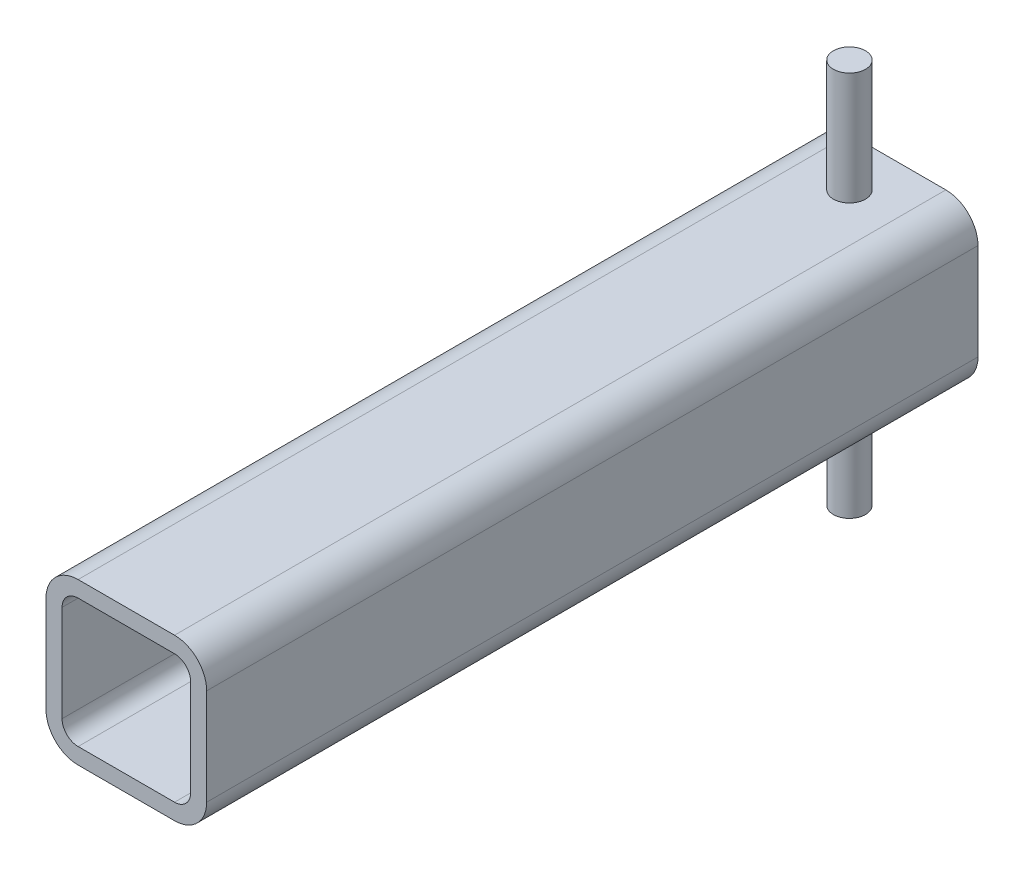
ISO-10303-21;
HEADER;
FILE_DESCRIPTION(('STEP AP214'),'2;1');
FILE_NAME('part.step','',(''),(''),'','','');
FILE_SCHEMA(('AUTOMOTIVE_DESIGN { 1 0 10303 214 1 1 1 1 }'));
ENDSEC;
DATA;
#1=APPLICATION_CONTEXT('core data for automotive mechanical design processes');
#2=APPLICATION_PROTOCOL_DEFINITION('international standard','automotive_design',2000,#1);
#3=PRODUCT_CONTEXT('',#1,'mechanical');
#4=PRODUCT('Part','Part','',(#3));
#5=PRODUCT_RELATED_PRODUCT_CATEGORY('part','',(#4));
#6=PRODUCT_DEFINITION_FORMATION('','',#4);
#7=PRODUCT_DEFINITION_CONTEXT('part definition',#1,'design');
#8=PRODUCT_DEFINITION('design','',#6,#7);
#9=PRODUCT_DEFINITION_SHAPE('','',#8);
#10=(LENGTH_UNIT() NAMED_UNIT(*) SI_UNIT(.MILLI.,.METRE.));
#11=(NAMED_UNIT(*) PLANE_ANGLE_UNIT() SI_UNIT($,.RADIAN.));
#12=(NAMED_UNIT(*) SI_UNIT($,.STERADIAN.) SOLID_ANGLE_UNIT());
#13=UNCERTAINTY_MEASURE_WITH_UNIT(LENGTH_MEASURE(1.E-05),#10,'distance_accuracy_value','');
#14=(GEOMETRIC_REPRESENTATION_CONTEXT(3) GLOBAL_UNCERTAINTY_ASSIGNED_CONTEXT((#13)) GLOBAL_UNIT_ASSIGNED_CONTEXT((#10,
#11,#12)) REPRESENTATION_CONTEXT('',''));
#15=CARTESIAN_POINT('',(0.,0.,0.));
#16=DIRECTION('',(0.,0.,1.));
#17=DIRECTION('',(1.,0.,0.));
#18=AXIS2_PLACEMENT_3D('',#15,#16,#17);
#19=CARTESIAN_POINT('',(0.,31.75,304.8));
#20=DIRECTION('',(0.,-1.,0.));
#21=DIRECTION('',(1.,0.,0.));
#22=AXIS2_PLACEMENT_3D('',#19,#20,#21);
#23=PLANE('',#22);
#24=DIRECTION('',(-1.,0.,0.));
#25=VECTOR('',#24,1.);
#26=CARTESIAN_POINT('',(0.,31.75,0.));
#27=LINE('',#26,#25);
#28=CARTESIAN_POINT('',(19.05,31.75,0.));
#29=VERTEX_POINT('',#28);
#30=CARTESIAN_POINT('',(-19.05,31.75,0.));
#31=VERTEX_POINT('',#30);
#32=EDGE_CURVE('E254',#29,#31,#27,.T.);
#33=ORIENTED_EDGE('',*,*,#32,.T.);
#34=DIRECTION('',(0.,0.,-1.));
#35=VECTOR('',#34,1.);
#36=CARTESIAN_POINT('',(-19.05,31.75,304.8));
#37=LINE('',#36,#35);
#38=CARTESIAN_POINT('',(-19.05,31.75,304.8));
#39=VERTEX_POINT('',#38);
#40=EDGE_CURVE('E297',#39,#31,#37,.T.);
#41=ORIENTED_EDGE('',*,*,#40,.F.);
#42=DIRECTION('',(-1.,0.,0.));
#43=VECTOR('',#42,1.);
#44=CARTESIAN_POINT('',(0.,31.75,304.8));
#45=LINE('',#44,#43);
#46=CARTESIAN_POINT('',(19.05,31.75,304.8));
#47=VERTEX_POINT('',#46);
#48=EDGE_CURVE('E382',#47,#39,#45,.T.);
#49=ORIENTED_EDGE('',*,*,#48,.F.);
#50=DIRECTION('',(0.,0.,-1.));
#51=VECTOR('',#50,1.);
#52=CARTESIAN_POINT('',(19.05,31.75,304.8));
#53=LINE('',#52,#51);
#54=EDGE_CURVE('E280',#47,#29,#53,.T.);
#55=ORIENTED_EDGE('',*,*,#54,.T.);
#56=EDGE_LOOP('',(#33,#41,#49,#55));
#57=FACE_BOUND('',#56,.T.);
#58=CARTESIAN_POINT('',(0.,31.75,19.05));
#59=DIRECTION('',(0.,-1.,0.));
#60=DIRECTION('',(1.,0.,0.));
#61=AXIS2_PLACEMENT_3D('',#58,#59,#60);
#62=CIRCLE('',#61,6.35);
#63=CARTESIAN_POINT('',(6.35,31.75,19.05));
#64=VERTEX_POINT('',#63);
#65=EDGE_CURVE('E11',#64,#64,#62,.F.);
#66=ORIENTED_EDGE('',*,*,#65,.F.);
#67=EDGE_LOOP('',(#66));
#68=FACE_BOUND('',#67,.T.);
#69=ADVANCED_FACE('F39',(#57,#68),#23,.F.);
#70=CARTESIAN_POINT('',(0.,-31.75,304.8));
#71=DIRECTION('',(0.,1.,0.));
#72=DIRECTION('',(-1.,0.,0.));
#73=AXIS2_PLACEMENT_3D('',#70,#71,#72);
#74=PLANE('',#73);
#75=DIRECTION('',(1.,0.,0.));
#76=VECTOR('',#75,1.);
#77=CARTESIAN_POINT('',(0.,-31.75,0.));
#78=LINE('',#77,#76);
#79=CARTESIAN_POINT('',(-19.05,-31.75,0.));
#80=VERTEX_POINT('',#79);
#81=CARTESIAN_POINT('',(19.05,-31.75,0.));
#82=VERTEX_POINT('',#81);
#83=EDGE_CURVE('E269',#80,#82,#78,.T.);
#84=ORIENTED_EDGE('',*,*,#83,.T.);
#85=DIRECTION('',(0.,0.,-1.));
#86=VECTOR('',#85,1.);
#87=CARTESIAN_POINT('',(19.05,-31.75,304.8));
#88=LINE('',#87,#86);
#89=CARTESIAN_POINT('',(19.05,-31.75,304.8));
#90=VERTEX_POINT('',#89);
#91=EDGE_CURVE('E209',#90,#82,#88,.T.);
#92=ORIENTED_EDGE('',*,*,#91,.F.);
#93=DIRECTION('',(1.,0.,0.));
#94=VECTOR('',#93,1.);
#95=CARTESIAN_POINT('',(0.,-31.75,304.8));
#96=LINE('',#95,#94);
#97=CARTESIAN_POINT('',(-19.05,-31.75,304.8));
#98=VERTEX_POINT('',#97);
#99=EDGE_CURVE('E194',#98,#90,#96,.T.);
#100=ORIENTED_EDGE('',*,*,#99,.F.);
#101=DIRECTION('',(0.,0.,-1.));
#102=VECTOR('',#101,1.);
#103=CARTESIAN_POINT('',(-19.05,-31.75,304.8));
#104=LINE('',#103,#102);
#105=EDGE_CURVE('E287',#98,#80,#104,.T.);
#106=ORIENTED_EDGE('',*,*,#105,.T.);
#107=EDGE_LOOP('',(#84,#92,#100,#106));
#108=FACE_BOUND('',#107,.T.);
#109=CARTESIAN_POINT('',(0.,-31.75,19.05));
#110=DIRECTION('',(0.,1.,0.));
#111=DIRECTION('',(-1.,0.,0.));
#112=AXIS2_PLACEMENT_3D('',#109,#110,#111);
#113=CIRCLE('',#112,6.35);
#114=CARTESIAN_POINT('',(-6.35,-31.75,19.05));
#115=VERTEX_POINT('',#114);
#116=EDGE_CURVE('E50',#115,#115,#113,.F.);
#117=ORIENTED_EDGE('',*,*,#116,.F.);
#118=EDGE_LOOP('',(#117));
#119=FACE_BOUND('',#118,.T.);
#120=ADVANCED_FACE('F435',(#108,#119),#74,.F.);
#121=CARTESIAN_POINT('',(0.,25.4,304.8));
#122=DIRECTION('',(0.,-1.,0.));
#123=DIRECTION('',(1.,0.,0.));
#124=AXIS2_PLACEMENT_3D('',#121,#122,#123);
#125=PLANE('',#124);
#126=DIRECTION('',(-1.,0.,0.));
#127=VECTOR('',#126,1.);
#128=CARTESIAN_POINT('',(0.,25.4,0.));
#129=LINE('',#128,#127);
#130=CARTESIAN_POINT('',(19.05,25.4,0.));
#131=VERTEX_POINT('',#130);
#132=CARTESIAN_POINT('',(-19.05,25.4,0.));
#133=VERTEX_POINT('',#132);
#134=EDGE_CURVE('E234',#131,#133,#129,.T.);
#135=ORIENTED_EDGE('',*,*,#134,.F.);
#136=DIRECTION('',(0.,0.,-1.));
#137=VECTOR('',#136,1.);
#138=CARTESIAN_POINT('',(19.05,25.4,304.8));
#139=LINE('',#138,#137);
#140=CARTESIAN_POINT('',(19.05,25.4,304.8));
#141=VERTEX_POINT('',#140);
#142=EDGE_CURVE('E312',#141,#131,#139,.T.);
#143=ORIENTED_EDGE('',*,*,#142,.F.);
#144=DIRECTION('',(-1.,0.,0.));
#145=VECTOR('',#144,1.);
#146=CARTESIAN_POINT('',(0.,25.4,304.8));
#147=LINE('',#146,#145);
#148=CARTESIAN_POINT('',(-19.05,25.4,304.8));
#149=VERTEX_POINT('',#148);
#150=EDGE_CURVE('E362',#141,#149,#147,.T.);
#151=ORIENTED_EDGE('',*,*,#150,.T.);
#152=DIRECTION('',(0.,0.,-1.));
#153=VECTOR('',#152,1.);
#154=CARTESIAN_POINT('',(-19.05,25.4,304.8));
#155=LINE('',#154,#153);
#156=EDGE_CURVE('E315',#149,#133,#155,.T.);
#157=ORIENTED_EDGE('',*,*,#156,.T.);
#158=EDGE_LOOP('',(#135,#143,#151,#157));
#159=FACE_BOUND('',#158,.T.);
#160=CARTESIAN_POINT('',(0.,25.4,19.05));
#161=DIRECTION('',(0.,-1.,0.));
#162=DIRECTION('',(1.,0.,0.));
#163=AXIS2_PLACEMENT_3D('',#160,#161,#162);
#164=CIRCLE('',#163,6.35);
#165=CARTESIAN_POINT('',(6.35,25.4,19.05));
#166=VERTEX_POINT('',#165);
#167=EDGE_CURVE('E226',#166,#166,#164,.F.);
#168=ORIENTED_EDGE('',*,*,#167,.T.);
#169=EDGE_LOOP('',(#168));
#170=FACE_BOUND('',#169,.T.);
#171=ADVANCED_FACE('F358',(#159,#170),#125,.T.);
#172=CARTESIAN_POINT('',(0.,-25.4,304.8));
#173=DIRECTION('',(0.,1.,0.));
#174=DIRECTION('',(-1.,0.,0.));
#175=AXIS2_PLACEMENT_3D('',#172,#173,#174);
#176=PLANE('',#175);
#177=DIRECTION('',(1.,0.,0.));
#178=VECTOR('',#177,1.);
#179=CARTESIAN_POINT('',(0.,-25.4,0.));
#180=LINE('',#179,#178);
#181=CARTESIAN_POINT('',(-19.05,-25.4,0.));
#182=VERTEX_POINT('',#181);
#183=CARTESIAN_POINT('',(19.05,-25.4,0.));
#184=VERTEX_POINT('',#183);
#185=EDGE_CURVE('E250',#182,#184,#180,.T.);
#186=ORIENTED_EDGE('',*,*,#185,.F.);
#187=DIRECTION('',(0.,0.,-1.));
#188=VECTOR('',#187,1.);
#189=CARTESIAN_POINT('',(-19.05,-25.4,304.8));
#190=LINE('',#189,#188);
#191=CARTESIAN_POINT('',(-19.05,-25.4,304.8));
#192=VERTEX_POINT('',#191);
#193=EDGE_CURVE('E217',#192,#182,#190,.T.);
#194=ORIENTED_EDGE('',*,*,#193,.F.);
#195=DIRECTION('',(1.,0.,0.));
#196=VECTOR('',#195,1.);
#197=CARTESIAN_POINT('',(0.,-25.4,304.8));
#198=LINE('',#197,#196);
#199=CARTESIAN_POINT('',(19.05,-25.4,304.8));
#200=VERTEX_POINT('',#199);
#201=EDGE_CURVE('E337',#192,#200,#198,.T.);
#202=ORIENTED_EDGE('',*,*,#201,.T.);
#203=DIRECTION('',(0.,0.,-1.));
#204=VECTOR('',#203,1.);
#205=CARTESIAN_POINT('',(19.05,-25.4,304.8));
#206=LINE('',#205,#204);
#207=EDGE_CURVE('E303',#200,#184,#206,.T.);
#208=ORIENTED_EDGE('',*,*,#207,.T.);
#209=EDGE_LOOP('',(#186,#194,#202,#208));
#210=FACE_BOUND('',#209,.T.);
#211=CARTESIAN_POINT('',(0.,-25.4,19.05));
#212=DIRECTION('',(0.,1.,0.));
#213=DIRECTION('',(-1.,0.,0.));
#214=AXIS2_PLACEMENT_3D('',#211,#212,#213);
#215=CIRCLE('',#214,6.35);
#216=CARTESIAN_POINT('',(-6.35,-25.4,19.05));
#217=VERTEX_POINT('',#216);
#218=EDGE_CURVE('E43',#217,#217,#215,.F.);
#219=ORIENTED_EDGE('',*,*,#218,.T.);
#220=EDGE_LOOP('',(#219));
#221=FACE_BOUND('',#220,.T.);
#222=ADVANCED_FACE('F335',(#210,#221),#176,.T.);
#223=CARTESIAN_POINT('',(-19.05,19.05,304.8));
#224=DIRECTION('',(0.,0.,-1.));
#225=DIRECTION('',(-1.,0.,0.));
#226=AXIS2_PLACEMENT_3D('',#223,#224,#225);
#227=CYLINDRICAL_SURFACE('',#226,12.7);
#228=CARTESIAN_POINT('',(-19.05,19.05,0.));
#229=DIRECTION('',(0.,0.,1.));
#230=DIRECTION('',(1.,0.,0.));
#231=AXIS2_PLACEMENT_3D('',#228,#229,#230);
#232=CIRCLE('',#231,12.7);
#233=CARTESIAN_POINT('',(-31.75,19.05,0.));
#234=VERTEX_POINT('',#233);
#235=EDGE_CURVE('E258',#31,#234,#232,.T.);
#236=ORIENTED_EDGE('',*,*,#235,.T.);
#237=DIRECTION('',(0.,0.,-1.));
#238=VECTOR('',#237,1.);
#239=CARTESIAN_POINT('',(-31.75,19.05,304.8));
#240=LINE('',#239,#238);
#241=CARTESIAN_POINT('',(-31.75,19.05,304.8));
#242=VERTEX_POINT('',#241);
#243=EDGE_CURVE('E294',#242,#234,#240,.T.);
#244=ORIENTED_EDGE('',*,*,#243,.F.);
#245=CARTESIAN_POINT('',(-19.05,19.05,304.8));
#246=DIRECTION('',(0.,0.,1.));
#247=DIRECTION('',(1.,0.,0.));
#248=AXIS2_PLACEMENT_3D('',#245,#246,#247);
#249=CIRCLE('',#248,12.7);
#250=EDGE_CURVE('E384',#39,#242,#249,.T.);
#251=ORIENTED_EDGE('',*,*,#250,.F.);
#252=ORIENTED_EDGE('',*,*,#40,.T.);
#253=EDGE_LOOP('',(#236,#244,#251,#252));
#254=FACE_BOUND('',#253,.T.);
#255=ADVANCED_FACE('F446',(#254),#227,.T.);
#256=CARTESIAN_POINT('',(-31.7499999999999,-69.9914213562374,304.8));
#257=DIRECTION('',(-1.,0.,0.));
#258=DIRECTION('',(0.,-1.,0.));
#259=AXIS2_PLACEMENT_3D('',#256,#257,#258);
#260=PLANE('',#259);
#261=DIRECTION('',(0.,1.,0.));
#262=VECTOR('',#261,1.);
#263=CARTESIAN_POINT('',(-31.7499999999999,-69.9914213562374,0.));
#264=LINE('',#263,#262);
#265=CARTESIAN_POINT('',(-31.75,-19.05,0.));
#266=VERTEX_POINT('',#265);
#267=EDGE_CURVE('E262',#266,#234,#264,.T.);
#268=ORIENTED_EDGE('',*,*,#267,.F.);
#269=DIRECTION('',(0.,0.,-1.));
#270=VECTOR('',#269,1.);
#271=CARTESIAN_POINT('',(-31.75,-19.05,304.8));
#272=LINE('',#271,#270);
#273=CARTESIAN_POINT('',(-31.75,-19.05,304.8));
#274=VERTEX_POINT('',#273);
#275=EDGE_CURVE('E291',#274,#266,#272,.T.);
#276=ORIENTED_EDGE('',*,*,#275,.F.);
#277=DIRECTION('',(0.,1.,0.));
#278=VECTOR('',#277,1.);
#279=CARTESIAN_POINT('',(-31.7499999999999,-69.9914213562374,304.8));
#280=LINE('',#279,#278);
#281=EDGE_CURVE('E386',#274,#242,#280,.T.);
#282=ORIENTED_EDGE('',*,*,#281,.T.);
#283=ORIENTED_EDGE('',*,*,#243,.T.);
#284=EDGE_LOOP('',(#268,#276,#282,#283));
#285=FACE_BOUND('',#284,.T.);
#286=ADVANCED_FACE('F476',(#285),#260,.T.);
#287=CARTESIAN_POINT('',(-19.05,-19.05,304.8));
#288=DIRECTION('',(0.,0.,-1.));
#289=DIRECTION('',(-1.,0.,0.));
#290=AXIS2_PLACEMENT_3D('',#287,#288,#289);
#291=CYLINDRICAL_SURFACE('',#290,12.7);
#292=CARTESIAN_POINT('',(-19.05,-19.05,0.));
#293=DIRECTION('',(0.,0.,1.));
#294=DIRECTION('',(1.,0.,0.));
#295=AXIS2_PLACEMENT_3D('',#292,#293,#294);
#296=CIRCLE('',#295,12.7);
#297=EDGE_CURVE('E266',#266,#80,#296,.T.);
#298=ORIENTED_EDGE('',*,*,#297,.T.);
#299=ORIENTED_EDGE('',*,*,#105,.F.);
#300=CARTESIAN_POINT('',(-19.05,-19.05,304.8));
#301=DIRECTION('',(0.,0.,1.));
#302=DIRECTION('',(1.,0.,0.));
#303=AXIS2_PLACEMENT_3D('',#300,#301,#302);
#304=CIRCLE('',#303,12.7);
#305=EDGE_CURVE('E390',#274,#98,#304,.T.);
#306=ORIENTED_EDGE('',*,*,#305,.F.);
#307=ORIENTED_EDGE('',*,*,#275,.T.);
#308=EDGE_LOOP('',(#298,#299,#306,#307));
#309=FACE_BOUND('',#308,.T.);
#310=ADVANCED_FACE('F471',(#309),#291,.T.);
#311=CARTESIAN_POINT('',(19.05,-19.05,304.8));
#312=DIRECTION('',(0.,0.,-1.));
#313=DIRECTION('',(-1.,0.,0.));
#314=AXIS2_PLACEMENT_3D('',#311,#312,#313);
#315=CYLINDRICAL_SURFACE('',#314,12.7);
#316=CARTESIAN_POINT('',(19.05,-19.05,0.));
#317=DIRECTION('',(0.,0.,1.));
#318=DIRECTION('',(1.,0.,0.));
#319=AXIS2_PLACEMENT_3D('',#316,#317,#318);
#320=CIRCLE('',#319,12.7);
#321=CARTESIAN_POINT('',(31.75,-19.05,0.));
#322=VERTEX_POINT('',#321);
#323=EDGE_CURVE('E204',#82,#322,#320,.T.);
#324=ORIENTED_EDGE('',*,*,#323,.T.);
#325=DIRECTION('',(0.,0.,-1.));
#326=VECTOR('',#325,1.);
#327=CARTESIAN_POINT('',(31.75,-19.05,304.8));
#328=LINE('',#327,#326);
#329=CARTESIAN_POINT('',(31.75,-19.05,304.8));
#330=VERTEX_POINT('',#329);
#331=EDGE_CURVE('E201',#330,#322,#328,.T.);
#332=ORIENTED_EDGE('',*,*,#331,.F.);
#333=CARTESIAN_POINT('',(19.05,-19.05,304.8));
#334=DIRECTION('',(0.,0.,1.));
#335=DIRECTION('',(1.,0.,0.));
#336=AXIS2_PLACEMENT_3D('',#333,#334,#335);
#337=CIRCLE('',#336,12.7);
#338=EDGE_CURVE('E188',#90,#330,#337,.T.);
#339=ORIENTED_EDGE('',*,*,#338,.F.);
#340=ORIENTED_EDGE('',*,*,#91,.T.);
#341=EDGE_LOOP('',(#324,#332,#339,#340));
#342=FACE_BOUND('',#341,.T.);
#343=ADVANCED_FACE('F202',(#342),#315,.T.);
#344=CARTESIAN_POINT('',(31.7500000000001,-69.9914213562373,304.8));
#345=DIRECTION('',(1.,0.,0.));
#346=DIRECTION('',(0.,1.,0.));
#347=AXIS2_PLACEMENT_3D('',#344,#345,#346);
#348=PLANE('',#347);
#349=DIRECTION('',(0.,-1.,0.));
#350=VECTOR('',#349,1.);
#351=CARTESIAN_POINT('',(31.7500000000001,-69.9914213562373,0.));
#352=LINE('',#351,#350);
#353=CARTESIAN_POINT('',(31.75,19.05,0.));
#354=VERTEX_POINT('',#353);
#355=EDGE_CURVE('E274',#354,#322,#352,.T.);
#356=ORIENTED_EDGE('',*,*,#355,.F.);
#357=DIRECTION('',(0.,0.,-1.));
#358=VECTOR('',#357,1.);
#359=CARTESIAN_POINT('',(31.75,19.05,304.8));
#360=LINE('',#359,#358);
#361=CARTESIAN_POINT('',(31.75,19.05,304.8));
#362=VERTEX_POINT('',#361);
#363=EDGE_CURVE('E128',#362,#354,#360,.T.);
#364=ORIENTED_EDGE('',*,*,#363,.F.);
#365=DIRECTION('',(0.,-1.,0.));
#366=VECTOR('',#365,1.);
#367=CARTESIAN_POINT('',(31.7500000000001,-69.9914213562373,304.8));
#368=LINE('',#367,#366);
#369=EDGE_CURVE('E192',#362,#330,#368,.T.);
#370=ORIENTED_EDGE('',*,*,#369,.T.);
#371=ORIENTED_EDGE('',*,*,#331,.T.);
#372=EDGE_LOOP('',(#356,#364,#370,#371));
#373=FACE_BOUND('',#372,.T.);
#374=ADVANCED_FACE('F211',(#373),#348,.T.);
#375=CARTESIAN_POINT('',(-19.05,-19.05,304.8));
#376=DIRECTION('',(0.,0.,-1.));
#377=DIRECTION('',(-1.,0.,0.));
#378=AXIS2_PLACEMENT_3D('',#375,#376,#377);
#379=CYLINDRICAL_SURFACE('',#378,6.34999999999999);
#380=CARTESIAN_POINT('',(-19.05,-19.05,0.));
#381=DIRECTION('',(0.,0.,1.));
#382=DIRECTION('',(1.,0.,0.));
#383=AXIS2_PLACEMENT_3D('',#380,#381,#382);
#384=CIRCLE('',#383,6.34999999999999);
#385=CARTESIAN_POINT('',(-25.4,-19.05,0.));
#386=VERTEX_POINT('',#385);
#387=EDGE_CURVE('E221',#386,#182,#384,.T.);
#388=ORIENTED_EDGE('',*,*,#387,.F.);
#389=DIRECTION('',(0.,0.,-1.));
#390=VECTOR('',#389,1.);
#391=CARTESIAN_POINT('',(-25.4,-19.05,304.8));
#392=LINE('',#391,#390);
#393=CARTESIAN_POINT('',(-25.4,-19.05,304.8));
#394=VERTEX_POINT('',#393);
#395=EDGE_CURVE('E142',#394,#386,#392,.T.);
#396=ORIENTED_EDGE('',*,*,#395,.F.);
#397=CARTESIAN_POINT('',(-19.05,-19.05,304.8));
#398=DIRECTION('',(0.,0.,1.));
#399=DIRECTION('',(1.,0.,0.));
#400=AXIS2_PLACEMENT_3D('',#397,#398,#399);
#401=CIRCLE('',#400,6.34999999999999);
#402=EDGE_CURVE('E279',#394,#192,#401,.T.);
#403=ORIENTED_EDGE('',*,*,#402,.T.);
#404=ORIENTED_EDGE('',*,*,#193,.T.);
#405=EDGE_LOOP('',(#388,#396,#403,#404));
#406=FACE_BOUND('',#405,.T.);
#407=ADVANCED_FACE('F41',(#406),#379,.F.);
#408=CARTESIAN_POINT('',(-25.3999999999999,-69.9914213562373,304.8));
#409=DIRECTION('',(-1.,0.,0.));
#410=DIRECTION('',(0.,-1.,0.));
#411=AXIS2_PLACEMENT_3D('',#408,#409,#410);
#412=PLANE('',#411);
#413=DIRECTION('',(0.,1.,0.));
#414=VECTOR('',#413,1.);
#415=CARTESIAN_POINT('',(-25.3999999999999,-69.9914213562373,0.));
#416=LINE('',#415,#414);
#417=CARTESIAN_POINT('',(-25.4,19.05,0.));
#418=VERTEX_POINT('',#417);
#419=EDGE_CURVE('E225',#386,#418,#416,.T.);
#420=ORIENTED_EDGE('',*,*,#419,.T.);
#421=DIRECTION('',(0.,0.,-1.));
#422=VECTOR('',#421,1.);
#423=CARTESIAN_POINT('',(-25.4,19.05,304.8));
#424=LINE('',#423,#422);
#425=CARTESIAN_POINT('',(-25.4,19.05,304.8));
#426=VERTEX_POINT('',#425);
#427=EDGE_CURVE('E318',#426,#418,#424,.T.);
#428=ORIENTED_EDGE('',*,*,#427,.F.);
#429=DIRECTION('',(0.,1.,0.));
#430=VECTOR('',#429,1.);
#431=CARTESIAN_POINT('',(-25.3999999999999,-69.9914213562373,304.8));
#432=LINE('',#431,#430);
#433=EDGE_CURVE('E325',#394,#426,#432,.T.);
#434=ORIENTED_EDGE('',*,*,#433,.F.);
#435=ORIENTED_EDGE('',*,*,#395,.T.);
#436=EDGE_LOOP('',(#420,#428,#434,#435));
#437=FACE_BOUND('',#436,.T.);
#438=ADVANCED_FACE('F323',(#437),#412,.F.);
#439=CARTESIAN_POINT('',(-19.05,19.05,304.8));
#440=DIRECTION('',(0.,0.,-1.));
#441=DIRECTION('',(-1.,0.,0.));
#442=AXIS2_PLACEMENT_3D('',#439,#440,#441);
#443=CYLINDRICAL_SURFACE('',#442,6.34999999999999);
#444=CARTESIAN_POINT('',(-19.05,19.05,0.));
#445=DIRECTION('',(0.,0.,1.));
#446=DIRECTION('',(1.,0.,0.));
#447=AXIS2_PLACEMENT_3D('',#444,#445,#446);
#448=CIRCLE('',#447,6.34999999999999);
#449=EDGE_CURVE('E230',#133,#418,#448,.T.);
#450=ORIENTED_EDGE('',*,*,#449,.F.);
#451=ORIENTED_EDGE('',*,*,#156,.F.);
#452=CARTESIAN_POINT('',(-19.05,19.05,304.8));
#453=DIRECTION('',(0.,0.,1.));
#454=DIRECTION('',(1.,0.,0.));
#455=AXIS2_PLACEMENT_3D('',#452,#453,#454);
#456=CIRCLE('',#455,6.34999999999999);
#457=EDGE_CURVE('E367',#149,#426,#456,.T.);
#458=ORIENTED_EDGE('',*,*,#457,.T.);
#459=ORIENTED_EDGE('',*,*,#427,.T.);
#460=EDGE_LOOP('',(#450,#451,#458,#459));
#461=FACE_BOUND('',#460,.T.);
#462=ADVANCED_FACE('F366',(#461),#443,.F.);
#463=CARTESIAN_POINT('',(19.05,19.05,304.8));
#464=DIRECTION('',(0.,0.,-1.));
#465=DIRECTION('',(-1.,0.,0.));
#466=AXIS2_PLACEMENT_3D('',#463,#464,#465);
#467=CYLINDRICAL_SURFACE('',#466,6.34999999999999);
#468=CARTESIAN_POINT('',(19.05,19.05,0.));
#469=DIRECTION('',(0.,0.,1.));
#470=DIRECTION('',(1.,0.,0.));
#471=AXIS2_PLACEMENT_3D('',#468,#469,#470);
#472=CIRCLE('',#471,6.34999999999999);
#473=CARTESIAN_POINT('',(25.4,19.05,0.));
#474=VERTEX_POINT('',#473);
#475=EDGE_CURVE('E238',#474,#131,#472,.T.);
#476=ORIENTED_EDGE('',*,*,#475,.F.);
#477=DIRECTION('',(0.,0.,-1.));
#478=VECTOR('',#477,1.);
#479=CARTESIAN_POINT('',(25.4,19.05,304.8));
#480=LINE('',#479,#478);
#481=CARTESIAN_POINT('',(25.4,19.05,304.8));
#482=VERTEX_POINT('',#481);
#483=EDGE_CURVE('E309',#482,#474,#480,.T.);
#484=ORIENTED_EDGE('',*,*,#483,.F.);
#485=CARTESIAN_POINT('',(19.05,19.05,304.8));
#486=DIRECTION('',(0.,0.,1.));
#487=DIRECTION('',(1.,0.,0.));
#488=AXIS2_PLACEMENT_3D('',#485,#486,#487);
#489=CIRCLE('',#488,6.34999999999999);
#490=EDGE_CURVE('E355',#482,#141,#489,.T.);
#491=ORIENTED_EDGE('',*,*,#490,.T.);
#492=ORIENTED_EDGE('',*,*,#142,.T.);
#493=EDGE_LOOP('',(#476,#484,#491,#492));
#494=FACE_BOUND('',#493,.T.);
#495=ADVANCED_FACE('F354',(#494),#467,.F.);
#496=CARTESIAN_POINT('',(25.4,-69.9914213562373,304.8));
#497=DIRECTION('',(1.,0.,0.));
#498=DIRECTION('',(0.,0.,-1.));
#499=AXIS2_PLACEMENT_3D('',#496,#497,#498);
#500=PLANE('',#499);
#501=DIRECTION('',(0.,-1.,0.));
#502=VECTOR('',#501,1.);
#503=CARTESIAN_POINT('',(25.4,-69.9914213562373,0.));
#504=LINE('',#503,#502);
#505=CARTESIAN_POINT('',(25.4,-19.05,0.));
#506=VERTEX_POINT('',#505);
#507=EDGE_CURVE('E242',#474,#506,#504,.T.);
#508=ORIENTED_EDGE('',*,*,#507,.T.);
#509=DIRECTION('',(0.,0.,-1.));
#510=VECTOR('',#509,1.);
#511=CARTESIAN_POINT('',(25.4,-19.05,304.8));
#512=LINE('',#511,#510);
#513=CARTESIAN_POINT('',(25.4,-19.05,304.8));
#514=VERTEX_POINT('',#513);
#515=EDGE_CURVE('E306',#514,#506,#512,.T.);
#516=ORIENTED_EDGE('',*,*,#515,.F.);
#517=DIRECTION('',(0.,-1.,0.));
#518=VECTOR('',#517,1.);
#519=CARTESIAN_POINT('',(25.4,-69.9914213562373,304.8));
#520=LINE('',#519,#518);
#521=EDGE_CURVE('E350',#482,#514,#520,.T.);
#522=ORIENTED_EDGE('',*,*,#521,.F.);
#523=ORIENTED_EDGE('',*,*,#483,.T.);
#524=EDGE_LOOP('',(#508,#516,#522,#523));
#525=FACE_BOUND('',#524,.T.);
#526=ADVANCED_FACE('F349',(#525),#500,.F.);
#527=CARTESIAN_POINT('',(19.05,-19.05,304.8));
#528=DIRECTION('',(0.,0.,-1.));
#529=DIRECTION('',(-1.,0.,0.));
#530=AXIS2_PLACEMENT_3D('',#527,#528,#529);
#531=CYLINDRICAL_SURFACE('',#530,6.34999999999999);
#532=CARTESIAN_POINT('',(19.05,-19.05,0.));
#533=DIRECTION('',(0.,0.,1.));
#534=DIRECTION('',(1.,0.,0.));
#535=AXIS2_PLACEMENT_3D('',#532,#533,#534);
#536=CIRCLE('',#535,6.34999999999999);
#537=EDGE_CURVE('E246',#184,#506,#536,.T.);
#538=ORIENTED_EDGE('',*,*,#537,.F.);
#539=ORIENTED_EDGE('',*,*,#207,.F.);
#540=CARTESIAN_POINT('',(19.05,-19.05,304.8));
#541=DIRECTION('',(0.,0.,1.));
#542=DIRECTION('',(1.,0.,0.));
#543=AXIS2_PLACEMENT_3D('',#540,#541,#542);
#544=CIRCLE('',#543,6.34999999999999);
#545=EDGE_CURVE('E346',#200,#514,#544,.T.);
#546=ORIENTED_EDGE('',*,*,#545,.T.);
#547=ORIENTED_EDGE('',*,*,#515,.T.);
#548=EDGE_LOOP('',(#538,#539,#546,#547));
#549=FACE_BOUND('',#548,.T.);
#550=ADVANCED_FACE('F342',(#549),#531,.F.);
#551=CARTESIAN_POINT('',(19.05,19.05,304.8));
#552=DIRECTION('',(0.,0.,-1.));
#553=DIRECTION('',(-1.,0.,0.));
#554=AXIS2_PLACEMENT_3D('',#551,#552,#553);
#555=CYLINDRICAL_SURFACE('',#554,12.7);
#556=CARTESIAN_POINT('',(19.05,19.05,0.));
#557=DIRECTION('',(0.,0.,1.));
#558=DIRECTION('',(1.,0.,0.));
#559=AXIS2_PLACEMENT_3D('',#556,#557,#558);
#560=CIRCLE('',#559,12.7);
#561=EDGE_CURVE('E131',#354,#29,#560,.T.);
#562=ORIENTED_EDGE('',*,*,#561,.T.);
#563=ORIENTED_EDGE('',*,*,#54,.F.);
#564=CARTESIAN_POINT('',(19.05,19.05,304.8));
#565=DIRECTION('',(0.,0.,1.));
#566=DIRECTION('',(1.,0.,0.));
#567=AXIS2_PLACEMENT_3D('',#564,#565,#566);
#568=CIRCLE('',#567,12.7);
#569=EDGE_CURVE('E59',#362,#47,#568,.T.);
#570=ORIENTED_EDGE('',*,*,#569,.F.);
#571=ORIENTED_EDGE('',*,*,#363,.T.);
#572=EDGE_LOOP('',(#562,#563,#570,#571));
#573=FACE_BOUND('',#572,.T.);
#574=ADVANCED_FACE('F452',(#573),#555,.T.);
#575=CARTESIAN_POINT('',(0.,-69.9914213562373,304.8));
#576=DIRECTION('',(0.,0.,1.));
#577=DIRECTION('',(1.,0.,0.));
#578=AXIS2_PLACEMENT_3D('',#575,#576,#577);
#579=PLANE('',#578);
#580=ORIENTED_EDGE('',*,*,#402,.F.);
#581=ORIENTED_EDGE('',*,*,#433,.T.);
#582=ORIENTED_EDGE('',*,*,#457,.F.);
#583=ORIENTED_EDGE('',*,*,#150,.F.);
#584=ORIENTED_EDGE('',*,*,#490,.F.);
#585=ORIENTED_EDGE('',*,*,#521,.T.);
#586=ORIENTED_EDGE('',*,*,#545,.F.);
#587=ORIENTED_EDGE('',*,*,#201,.F.);
#588=EDGE_LOOP('',(#580,#581,#582,#583,#584,#585,#586,#587));
#589=FACE_BOUND('',#588,.T.);
#590=ORIENTED_EDGE('',*,*,#48,.T.);
#591=ORIENTED_EDGE('',*,*,#250,.T.);
#592=ORIENTED_EDGE('',*,*,#281,.F.);
#593=ORIENTED_EDGE('',*,*,#305,.T.);
#594=ORIENTED_EDGE('',*,*,#99,.T.);
#595=ORIENTED_EDGE('',*,*,#338,.T.);
#596=ORIENTED_EDGE('',*,*,#369,.F.);
#597=ORIENTED_EDGE('',*,*,#569,.T.);
#598=EDGE_LOOP('',(#590,#591,#592,#593,#594,#595,#596,#597));
#599=FACE_BOUND('',#598,.T.);
#600=ADVANCED_FACE('F190',(#589,#599),#579,.T.);
#601=CARTESIAN_POINT('',(0.,-69.9914213562373,0.));
#602=DIRECTION('',(0.,0.,1.));
#603=DIRECTION('',(1.,0.,0.));
#604=AXIS2_PLACEMENT_3D('',#601,#602,#603);
#605=PLANE('',#604);
#606=ORIENTED_EDGE('',*,*,#387,.T.);
#607=ORIENTED_EDGE('',*,*,#185,.T.);
#608=ORIENTED_EDGE('',*,*,#537,.T.);
#609=ORIENTED_EDGE('',*,*,#507,.F.);
#610=ORIENTED_EDGE('',*,*,#475,.T.);
#611=ORIENTED_EDGE('',*,*,#134,.T.);
#612=ORIENTED_EDGE('',*,*,#449,.T.);
#613=ORIENTED_EDGE('',*,*,#419,.F.);
#614=EDGE_LOOP('',(#606,#607,#608,#609,#610,#611,#612,#613));
#615=FACE_BOUND('',#614,.T.);
#616=ORIENTED_EDGE('',*,*,#32,.F.);
#617=ORIENTED_EDGE('',*,*,#561,.F.);
#618=ORIENTED_EDGE('',*,*,#355,.T.);
#619=ORIENTED_EDGE('',*,*,#323,.F.);
#620=ORIENTED_EDGE('',*,*,#83,.F.);
#621=ORIENTED_EDGE('',*,*,#297,.F.);
#622=ORIENTED_EDGE('',*,*,#267,.T.);
#623=ORIENTED_EDGE('',*,*,#235,.F.);
#624=EDGE_LOOP('',(#616,#617,#618,#619,#620,#621,#622,#623));
#625=FACE_BOUND('',#624,.T.);
#626=ADVANCED_FACE('F328',(#615,#625),#605,.F.);
#627=CARTESIAN_POINT('',(0.,76.2,19.05));
#628=DIRECTION('',(0.,-1.,0.));
#629=DIRECTION('',(0.,0.,-1.));
#630=AXIS2_PLACEMENT_3D('',#627,#628,#629);
#631=CYLINDRICAL_SURFACE('',#630,6.35);
#632=ORIENTED_EDGE('',*,*,#167,.F.);
#633=EDGE_LOOP('',(#632));
#634=FACE_BOUND('',#633,.T.);
#635=ORIENTED_EDGE('',*,*,#218,.F.);
#636=EDGE_LOOP('',(#635));
#637=FACE_BOUND('',#636,.T.);
#638=ADVANCED_FACE('F413',(#634,#637),#631,.T.);
#639=CARTESIAN_POINT('',(0.,-76.2,19.05));
#640=DIRECTION('',(0.,1.,0.));
#641=DIRECTION('',(0.,0.,1.));
#642=AXIS2_PLACEMENT_3D('',#639,#640,#641);
#643=PLANE('',#642);
#644=CARTESIAN_POINT('',(0.,-76.2,19.05));
#645=DIRECTION('',(0.,1.,0.));
#646=DIRECTION('',(0.,0.,1.));
#647=AXIS2_PLACEMENT_3D('',#644,#645,#646);
#648=CIRCLE('',#647,6.35);
#649=CARTESIAN_POINT('',(0.,-76.2,25.4));
#650=VERTEX_POINT('',#649);
#651=EDGE_CURVE('E401',#650,#650,#648,.T.);
#652=ORIENTED_EDGE('',*,*,#651,.F.);
#653=EDGE_LOOP('',(#652));
#654=FACE_BOUND('',#653,.T.);
#655=ADVANCED_FACE('F415',(#654),#643,.F.);
#656=ORIENTED_EDGE('',*,*,#651,.T.);
#657=EDGE_LOOP('',(#656));
#658=FACE_BOUND('',#657,.T.);
#659=ORIENTED_EDGE('',*,*,#116,.T.);
#660=EDGE_LOOP('',(#659));
#661=FACE_BOUND('',#660,.T.);
#662=ADVANCED_FACE('F419',(#658,#661),#631,.T.);
#663=CARTESIAN_POINT('',(0.,76.2,19.05));
#664=DIRECTION('',(0.,1.,0.));
#665=DIRECTION('',(0.,0.,1.));
#666=AXIS2_PLACEMENT_3D('',#663,#664,#665);
#667=CIRCLE('',#666,6.35);
#668=CARTESIAN_POINT('',(0.,76.2,25.4));
#669=VERTEX_POINT('',#668);
#670=EDGE_CURVE('E404',#669,#669,#667,.T.);
#671=ORIENTED_EDGE('',*,*,#670,.F.);
#672=EDGE_LOOP('',(#671));
#673=FACE_BOUND('',#672,.T.);
#674=ORIENTED_EDGE('',*,*,#65,.T.);
#675=EDGE_LOOP('',(#674));
#676=FACE_BOUND('',#675,.T.);
#677=ADVANCED_FACE('F418',(#673,#676),#631,.T.);
#678=CARTESIAN_POINT('',(0.,76.2,19.05));
#679=DIRECTION('',(0.,1.,0.));
#680=DIRECTION('',(0.,0.,1.));
#681=AXIS2_PLACEMENT_3D('',#678,#679,#680);
#682=PLANE('',#681);
#683=ORIENTED_EDGE('',*,*,#670,.T.);
#684=EDGE_LOOP('',(#683));
#685=FACE_BOUND('',#684,.T.);
#686=ADVANCED_FACE('F430',(#685),#682,.T.);
#687=CLOSED_SHELL('',(#69,#120,#171,#222,#255,#286,#310,#343,#374,#407,#438,#462,#495,#526,#550,
#574,#600,#626,#638,#655,#662,#677,#686));
#688=MANIFOLD_SOLID_BREP('B2',#687);
#689=ADVANCED_BREP_SHAPE_REPRESENTATION('',(#18,#688),#14);
#690=SHAPE_DEFINITION_REPRESENTATION(#9,#689);
ENDSEC;
END-ISO-10303-21;
